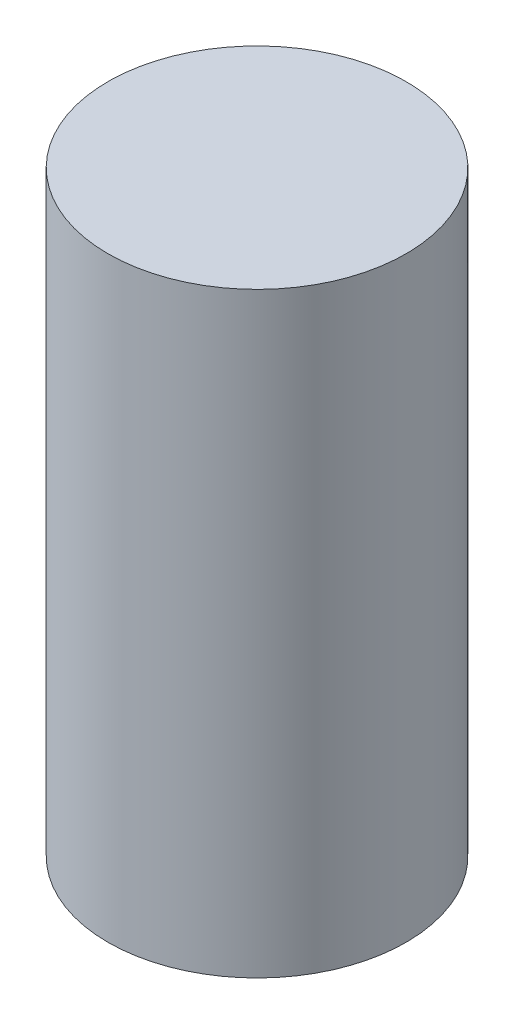
ISO-10303-21;
HEADER;
FILE_DESCRIPTION(('STEP AP214'),'2;1');
FILE_NAME('part.step','',(''),(''),'','','');
FILE_SCHEMA(('AUTOMOTIVE_DESIGN { 1 0 10303 214 1 1 1 1 }'));
ENDSEC;
DATA;
#1=APPLICATION_CONTEXT('core data for automotive mechanical design processes');
#2=APPLICATION_PROTOCOL_DEFINITION('international standard','automotive_design',2000,#1);
#3=PRODUCT_CONTEXT('',#1,'mechanical');
#4=PRODUCT('Part','Part','',(#3));
#5=PRODUCT_RELATED_PRODUCT_CATEGORY('part','',(#4));
#6=PRODUCT_DEFINITION_FORMATION('','',#4);
#7=PRODUCT_DEFINITION_CONTEXT('part definition',#1,'design');
#8=PRODUCT_DEFINITION('design','',#6,#7);
#9=PRODUCT_DEFINITION_SHAPE('','',#8);
#10=(LENGTH_UNIT() NAMED_UNIT(*) SI_UNIT(.MILLI.,.METRE.));
#11=(NAMED_UNIT(*) PLANE_ANGLE_UNIT() SI_UNIT($,.RADIAN.));
#12=(NAMED_UNIT(*) SI_UNIT($,.STERADIAN.) SOLID_ANGLE_UNIT());
#13=UNCERTAINTY_MEASURE_WITH_UNIT(LENGTH_MEASURE(1.E-05),#10,'distance_accuracy_value','');
#14=(GEOMETRIC_REPRESENTATION_CONTEXT(3) GLOBAL_UNCERTAINTY_ASSIGNED_CONTEXT((#13)) GLOBAL_UNIT_ASSIGNED_CONTEXT((#10,
#11,#12)) REPRESENTATION_CONTEXT('',''));
#15=CARTESIAN_POINT('',(0.,0.,0.));
#16=DIRECTION('',(0.,0.,1.));
#17=DIRECTION('',(1.,0.,0.));
#18=AXIS2_PLACEMENT_3D('',#15,#16,#17);
#19=CARTESIAN_POINT('',(0.,40.,0.));
#20=DIRECTION('',(0.,-1.,0.));
#21=DIRECTION('',(0.,0.,-1.));
#22=AXIS2_PLACEMENT_3D('',#19,#20,#21);
#23=CYLINDRICAL_SURFACE('',#22,10.);
#24=CARTESIAN_POINT('',(0.,40.,0.));
#25=DIRECTION('',(0.,1.,0.));
#26=DIRECTION('',(0.,0.,1.));
#27=AXIS2_PLACEMENT_3D('',#24,#25,#26);
#28=CIRCLE('',#27,10.);
#29=CARTESIAN_POINT('',(0.,40.,10.));
#30=VERTEX_POINT('',#29);
#31=EDGE_CURVE('E10',#30,#30,#28,.T.);
#32=ORIENTED_EDGE('',*,*,#31,.F.);
#33=EDGE_LOOP('',(#32));
#34=FACE_BOUND('',#33,.T.);
#35=CARTESIAN_POINT('',(0.,0.,0.));
#36=DIRECTION('',(0.,1.,0.));
#37=DIRECTION('',(0.,0.,1.));
#38=AXIS2_PLACEMENT_3D('',#35,#36,#37);
#39=CIRCLE('',#38,10.);
#40=CARTESIAN_POINT('',(0.,0.,10.));
#41=VERTEX_POINT('',#40);
#42=EDGE_CURVE('E35',#41,#41,#39,.T.);
#43=ORIENTED_EDGE('',*,*,#42,.T.);
#44=EDGE_LOOP('',(#43));
#45=FACE_BOUND('',#44,.T.);
#46=ADVANCED_FACE('F29',(#34,#45),#23,.T.);
#47=CARTESIAN_POINT('',(0.,40.,0.));
#48=DIRECTION('',(0.,1.,0.));
#49=DIRECTION('',(0.,0.,1.));
#50=AXIS2_PLACEMENT_3D('',#47,#48,#49);
#51=PLANE('',#50);
#52=ORIENTED_EDGE('',*,*,#31,.T.);
#53=EDGE_LOOP('',(#52));
#54=FACE_BOUND('',#53,.T.);
#55=ADVANCED_FACE('F44',(#54),#51,.T.);
#56=CARTESIAN_POINT('',(0.,0.,0.));
#57=DIRECTION('',(0.,1.,0.));
#58=DIRECTION('',(0.,0.,1.));
#59=AXIS2_PLACEMENT_3D('',#56,#57,#58);
#60=PLANE('',#59);
#61=ORIENTED_EDGE('',*,*,#42,.F.);
#62=EDGE_LOOP('',(#61));
#63=FACE_BOUND('',#62,.T.);
#64=ADVANCED_FACE('F42',(#63),#60,.F.);
#65=CLOSED_SHELL('',(#46,#55,#64));
#66=MANIFOLD_SOLID_BREP('B2',#65);
#67=ADVANCED_BREP_SHAPE_REPRESENTATION('',(#18,#66),#14);
#68=SHAPE_DEFINITION_REPRESENTATION(#9,#67);
ENDSEC;
END-ISO-10303-21;
